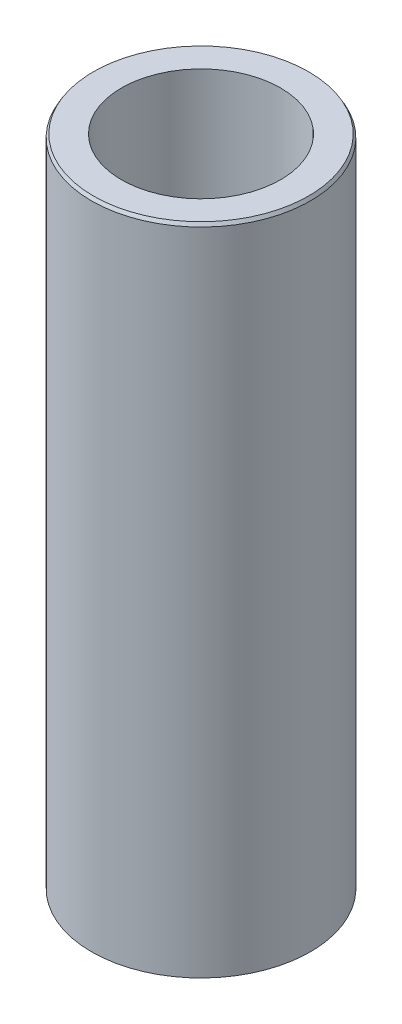
ISO-10303-21;
HEADER;
FILE_DESCRIPTION(('STEP AP214'),'2;1');
FILE_NAME('part.step','',(''),(''),'','','');
FILE_SCHEMA(('AUTOMOTIVE_DESIGN { 1 0 10303 214 1 1 1 1 }'));
ENDSEC;
DATA;
#1=APPLICATION_CONTEXT('core data for automotive mechanical design processes');
#2=APPLICATION_PROTOCOL_DEFINITION('international standard','automotive_design',2000,#1);
#3=PRODUCT_CONTEXT('',#1,'mechanical');
#4=PRODUCT('Part','Part','',(#3));
#5=PRODUCT_RELATED_PRODUCT_CATEGORY('part','',(#4));
#6=PRODUCT_DEFINITION_FORMATION('','',#4);
#7=PRODUCT_DEFINITION_CONTEXT('part definition',#1,'design');
#8=PRODUCT_DEFINITION('design','',#6,#7);
#9=PRODUCT_DEFINITION_SHAPE('','',#8);
#10=(LENGTH_UNIT() NAMED_UNIT(*) SI_UNIT(.MILLI.,.METRE.));
#11=(NAMED_UNIT(*) PLANE_ANGLE_UNIT() SI_UNIT($,.RADIAN.));
#12=(NAMED_UNIT(*) SI_UNIT($,.STERADIAN.) SOLID_ANGLE_UNIT());
#13=UNCERTAINTY_MEASURE_WITH_UNIT(LENGTH_MEASURE(1.E-05),#10,'distance_accuracy_value','');
#14=(GEOMETRIC_REPRESENTATION_CONTEXT(3) GLOBAL_UNCERTAINTY_ASSIGNED_CONTEXT((#13)) GLOBAL_UNIT_ASSIGNED_CONTEXT((#10,
#11,#12)) REPRESENTATION_CONTEXT('',''));
#15=CARTESIAN_POINT('',(0.,0.,0.));
#16=DIRECTION('',(0.,0.,1.));
#17=DIRECTION('',(1.,0.,0.));
#18=AXIS2_PLACEMENT_3D('',#15,#16,#17);
#19=CARTESIAN_POINT('',(0.,314.20717671091,0.));
#20=DIRECTION('',(0.,-1.,0.));
#21=DIRECTION('',(0.,0.,-1.));
#22=AXIS2_PLACEMENT_3D('',#19,#20,#21);
#23=CYLINDRICAL_SURFACE('',#22,52.5);
#24=CARTESIAN_POINT('',(0.,312.63607802207,0.));
#25=DIRECTION('',(0.,1.,0.));
#26=DIRECTION('',(0.,0.,1.));
#27=AXIS2_PLACEMENT_3D('',#24,#25,#26);
#28=CIRCLE('',#27,52.5);
#29=CARTESIAN_POINT('',(0.,312.63607802207,-52.5));
#30=VERTEX_POINT('',#29);
#31=EDGE_CURVE('E50',#30,#30,#28,.F.);
#32=CARTESIAN_POINT('',(0.,0.907074250925344,0.));
#33=DIRECTION('',(0.,1.,0.));
#34=DIRECTION('',(0.,0.,1.));
#35=AXIS2_PLACEMENT_3D('',#32,#33,#34);
#36=CIRCLE('',#35,52.5);
#37=CARTESIAN_POINT('',(0.,0.907074250925344,-52.5));
#38=VERTEX_POINT('',#37);
#39=EDGE_CURVE('E51',#38,#38,#36,.T.);
#40=CARTESIAN_POINT('',(0.,312.63607802207,-52.5));
#41=CARTESIAN_POINT('',(0.,309.388900899454,-52.5));
#42=CARTESIAN_POINT('',(0.,306.141723776838,-52.5));
#43=CARTESIAN_POINT('',(0.,299.647369531606,-52.5));
#44=CARTESIAN_POINT('',(0.,296.40019240899,-52.5));
#45=CARTESIAN_POINT('',(0.,289.905838163758,-52.5));
#46=CARTESIAN_POINT('',(0.,286.658661041141,-52.5));
#47=CARTESIAN_POINT('',(0.,280.164306795909,-52.5));
#48=CARTESIAN_POINT('',(0.,276.917129673293,-52.5));
#49=CARTESIAN_POINT('',(0.,270.422775428061,-52.5));
#50=CARTESIAN_POINT('',(0.,267.175598305445,-52.5));
#51=CARTESIAN_POINT('',(0.,260.681244060213,-52.5));
#52=CARTESIAN_POINT('',(0.,257.434066937597,-52.5));
#53=CARTESIAN_POINT('',(0.,250.939712692364,-52.5));
#54=CARTESIAN_POINT('',(0.,247.692535569748,-52.5));
#55=CARTESIAN_POINT('',(0.,241.198181324516,-52.5));
#56=CARTESIAN_POINT('',(0.,237.9510042019,-52.5));
#57=CARTESIAN_POINT('',(0.,231.456649956668,-52.5));
#58=CARTESIAN_POINT('',(0.,228.209472834052,-52.5));
#59=CARTESIAN_POINT('',(0.,221.71511858882,-52.5));
#60=CARTESIAN_POINT('',(0.,218.467941466204,-52.5));
#61=CARTESIAN_POINT('',(0.,211.973587220971,-52.5));
#62=CARTESIAN_POINT('',(0.,208.726410098355,-52.5));
#63=CARTESIAN_POINT('',(0.,202.232055853123,-52.5));
#64=CARTESIAN_POINT('',(0.,198.984878730507,-52.5));
#65=CARTESIAN_POINT('',(0.,192.490524485275,-52.5));
#66=CARTESIAN_POINT('',(0.,189.243347362659,-52.5));
#67=CARTESIAN_POINT('',(0.,182.748993117427,-52.5));
#68=CARTESIAN_POINT('',(0.,179.50181599481,-52.5));
#69=CARTESIAN_POINT('',(0.,173.007461749578,-52.5));
#70=CARTESIAN_POINT('',(0.,169.760284626962,-52.5));
#71=CARTESIAN_POINT('',(0.,163.26593038173,-52.5));
#72=CARTESIAN_POINT('',(0.,160.018753259114,-52.5));
#73=CARTESIAN_POINT('',(0.,153.524399013882,-52.5));
#74=CARTESIAN_POINT('',(0.,150.277221891266,-52.5));
#75=CARTESIAN_POINT('',(0.,143.782867646033,-52.5));
#76=CARTESIAN_POINT('',(0.,140.535690523417,-52.5));
#77=CARTESIAN_POINT('',(0.,134.041336278185,-52.5));
#78=CARTESIAN_POINT('',(0.,130.794159155569,-52.5));
#79=CARTESIAN_POINT('',(0.,124.299804910337,-52.5));
#80=CARTESIAN_POINT('',(0.,121.052627787721,-52.5));
#81=CARTESIAN_POINT('',(0.,114.558273542489,-52.5));
#82=CARTESIAN_POINT('',(0.,111.311096419872,-52.5));
#83=CARTESIAN_POINT('',(0.,104.81674217464,-52.5));
#84=CARTESIAN_POINT('',(0.,101.569565052024,-52.5));
#85=CARTESIAN_POINT('',(0.,95.075210806792,-52.5));
#86=CARTESIAN_POINT('',(0.,91.8280336841759,-52.5));
#87=CARTESIAN_POINT('',(0.,85.3336794389437,-52.5));
#88=CARTESIAN_POINT('',(0.,82.0865023163277,-52.5));
#89=CARTESIAN_POINT('',(0.,75.5921480710955,-52.5));
#90=CARTESIAN_POINT('',(0.,72.3449709484794,-52.5));
#91=CARTESIAN_POINT('',(0.,65.8506167032472,-52.5));
#92=CARTESIAN_POINT('',(0.,62.6034395806311,-52.5));
#93=CARTESIAN_POINT('',(0.,56.1090853353989,-52.5));
#94=CARTESIAN_POINT('',(0.,52.8619082127828,-52.5));
#95=CARTESIAN_POINT('',(0.,46.3675539675506,-52.5));
#96=CARTESIAN_POINT('',(0.,43.1203768449345,-52.5));
#97=CARTESIAN_POINT('',(0.,36.6260225997024,-52.5));
#98=CARTESIAN_POINT('',(0.,33.3788454770863,-52.5));
#99=CARTESIAN_POINT('',(0.,26.8844912318541,-52.5));
#100=CARTESIAN_POINT('',(0.,23.637314109238,-52.5));
#101=CARTESIAN_POINT('',(0.,17.1429598640058,-52.5));
#102=CARTESIAN_POINT('',(0.,13.8957827413897,-52.5));
#103=CARTESIAN_POINT('',(0.,7.40142849615753,-52.5));
#104=CARTESIAN_POINT('',(0.,4.15425137354144,-52.5));
#105=CARTESIAN_POINT('',(0.,0.907074250925344,-52.5));
#106=B_SPLINE_CURVE_WITH_KNOTS('',3,(#40,#41,#42,#43,#44,#45,#46,#47,#48,#49,#50,#51,#52,#53,
#54,#55,#56,#57,#58,#59,#60,#61,#62,#63,#64,#65,#66,#67,#68,#69,#70,#71,#72,#73,#74,#75,#76,#77,
#78,#79,#80,#81,#82,#83,#84,#85,#86,#87,#88,#89,#90,#91,#92,#93,#94,#95,#96,#97,#98,#99,#100,
#101,#102,#103,#104,#105),.UNSPECIFIED.,.F.,.F.,(4,2,2,2,2,2,2,2,2,2,2,2,2,2,2,2,2,2,2,2,2,2,2,
2,2,2,2,2,2,2,2,2,4),(0.,9.74153136784828,19.4830627356966,29.2245941035448,38.9661254713931,
48.7076568392414,58.4491882070897,68.1907195749379,77.9322509427862,87.6737823106345,
97.4153136784828,107.156845046331,116.898376414179,126.639907782028,136.381439149876,
146.122970517724,155.864501885572,165.606033253421,175.347564621269,185.089095989117,
194.830627356966,204.572158724814,214.313690092662,224.05522146051,233.796752828359,
243.538284196207,253.279815564055,263.021346931904,272.762878299752,282.5044096676,
292.245941035448,301.987472403297,311.729003771145),.UNSPECIFIED.);
#107=EDGE_CURVE('BSEAM39',#30,#38,#106,.T.);
#108=ORIENTED_EDGE('',*,*,#31,.T.);
#109=ORIENTED_EDGE('',*,*,#39,.T.);
#110=ORIENTED_EDGE('',*,*,#107,.T.);
#111=ORIENTED_EDGE('',*,*,#107,.F.);
#112=EDGE_LOOP('',(#108,#110,#109,#111));
#113=FACE_BOUND('',#112,.T.);
#114=ADVANCED_FACE('F39',(#113),#23,.T.);
#115=CARTESIAN_POINT('',(0.,314.20717671091,0.));
#116=DIRECTION('',(0.,1.,0.));
#117=DIRECTION('',(0.,0.,1.));
#118=AXIS2_PLACEMENT_3D('',#115,#116,#117);
#119=PLANE('',#118);
#120=CARTESIAN_POINT('',(0.,314.20717671091,0.));
#121=DIRECTION('',(0.,1.,0.));
#122=DIRECTION('',(0.,0.,1.));
#123=AXIS2_PLACEMENT_3D('',#120,#121,#122);
#124=CIRCLE('',#123,51.5929257490749);
#125=CARTESIAN_POINT('',(0.,314.20717671091,51.5929257490749));
#126=VERTEX_POINT('',#125);
#127=EDGE_CURVE('E54',#126,#126,#124,.T.);
#128=ORIENTED_EDGE('',*,*,#127,.T.);
#129=EDGE_LOOP('',(#128));
#130=FACE_BOUND('',#129,.T.);
#131=CARTESIAN_POINT('',(0.,314.20717671091,0.));
#132=DIRECTION('',(0.,1.,0.));
#133=DIRECTION('',(0.,0.,1.));
#134=AXIS2_PLACEMENT_3D('',#131,#132,#133);
#135=CIRCLE('',#134,38.1459132460685);
#136=CARTESIAN_POINT('',(0.,314.20717671091,-38.1459132460685));
#137=VERTEX_POINT('',#136);
#138=EDGE_CURVE('E58',#137,#137,#135,.T.);
#139=ORIENTED_EDGE('',*,*,#138,.F.);
#140=EDGE_LOOP('',(#139));
#141=FACE_BOUND('',#140,.T.);
#142=ADVANCED_FACE('F69',(#130,#141),#119,.T.);
#143=CARTESIAN_POINT('',(0.,0.,0.));
#144=DIRECTION('',(0.,1.,0.));
#145=DIRECTION('',(0.,0.,1.));
#146=AXIS2_PLACEMENT_3D('',#143,#144,#145);
#147=PLANE('',#146);
#148=CARTESIAN_POINT('',(0.,0.,0.));
#149=DIRECTION('',(0.,1.,0.));
#150=DIRECTION('',(0.,0.,1.));
#151=AXIS2_PLACEMENT_3D('',#148,#149,#150);
#152=CIRCLE('',#151,50.9289013111597);
#153=CARTESIAN_POINT('',(0.,0.,50.9289013111597));
#154=VERTEX_POINT('',#153);
#155=EDGE_CURVE('E10',#154,#154,#152,.F.);
#156=ORIENTED_EDGE('',*,*,#155,.T.);
#157=EDGE_LOOP('',(#156));
#158=FACE_BOUND('',#157,.T.);
#159=CARTESIAN_POINT('',(0.,0.,0.));
#160=DIRECTION('',(0.,1.,0.));
#161=DIRECTION('',(0.,0.,1.));
#162=AXIS2_PLACEMENT_3D('',#159,#160,#161);
#163=CIRCLE('',#162,38.1459132460685);
#164=CARTESIAN_POINT('',(0.,0.,-38.1459132460685));
#165=VERTEX_POINT('',#164);
#166=EDGE_CURVE('E63',#165,#165,#163,.T.);
#167=ORIENTED_EDGE('',*,*,#166,.T.);
#168=EDGE_LOOP('',(#167));
#169=FACE_BOUND('',#168,.T.);
#170=ADVANCED_FACE('F75',(#158,#169),#147,.F.);
#171=CARTESIAN_POINT('',(0.,314.20717671091,0.));
#172=DIRECTION('',(0.,-1.,0.));
#173=DIRECTION('',(0.,0.,-1.));
#174=AXIS2_PLACEMENT_3D('',#171,#172,#173);
#175=CYLINDRICAL_SURFACE('',#174,38.1459132460685);
#176=CARTESIAN_POINT('',(0.,314.20717671091,-38.1459132460685));
#177=CARTESIAN_POINT('',(0.,310.934185286838,-38.1459132460685));
#178=CARTESIAN_POINT('',(0.,307.661193862766,-38.1459132460685));
#179=CARTESIAN_POINT('',(0.,301.115211014622,-38.1459132460685));
#180=CARTESIAN_POINT('',(0.,297.84221959055,-38.1459132460685));
#181=CARTESIAN_POINT('',(0.,291.296236742406,-38.1459132460685));
#182=CARTESIAN_POINT('',(0.,288.023245318334,-38.1459132460685));
#183=CARTESIAN_POINT('',(0.,281.47726247019,-38.1459132460685));
#184=CARTESIAN_POINT('',(0.,278.204271046118,-38.1459132460685));
#185=CARTESIAN_POINT('',(0.,271.658288197974,-38.1459132460685));
#186=CARTESIAN_POINT('',(0.,268.385296773902,-38.1459132460685));
#187=CARTESIAN_POINT('',(0.,261.839313925758,-38.1459132460685));
#188=CARTESIAN_POINT('',(0.,258.566322501686,-38.1459132460685));
#189=CARTESIAN_POINT('',(0.,252.020339653542,-38.1459132460685));
#190=CARTESIAN_POINT('',(0.,248.74734822947,-38.1459132460685));
#191=CARTESIAN_POINT('',(0.,242.201365381326,-38.1459132460685));
#192=CARTESIAN_POINT('',(0.,238.928373957254,-38.1459132460685));
#193=CARTESIAN_POINT('',(0.,232.38239110911,-38.1459132460685));
#194=CARTESIAN_POINT('',(0.,229.109399685038,-38.1459132460685));
#195=CARTESIAN_POINT('',(0.,222.563416836894,-38.1459132460685));
#196=CARTESIAN_POINT('',(0.,219.290425412823,-38.1459132460685));
#197=CARTESIAN_POINT('',(0.,212.744442564679,-38.1459132460685));
#198=CARTESIAN_POINT('',(0.,209.471451140607,-38.1459132460685));
#199=CARTESIAN_POINT('',(0.,202.925468292463,-38.1459132460685));
#200=CARTESIAN_POINT('',(0.,199.652476868391,-38.1459132460685));
#201=CARTESIAN_POINT('',(0.,193.106494020247,-38.1459132460685));
#202=CARTESIAN_POINT('',(0.,189.833502596175,-38.1459132460685));
#203=CARTESIAN_POINT('',(0.,183.287519748031,-38.1459132460685));
#204=CARTESIAN_POINT('',(0.,180.014528323959,-38.1459132460685));
#205=CARTESIAN_POINT('',(0.,173.468545475815,-38.1459132460685));
#206=CARTESIAN_POINT('',(0.,170.195554051743,-38.1459132460685));
#207=CARTESIAN_POINT('',(0.,163.649571203599,-38.1459132460685));
#208=CARTESIAN_POINT('',(0.,160.376579779527,-38.1459132460685));
#209=CARTESIAN_POINT('',(0.,153.830596931383,-38.1459132460685));
#210=CARTESIAN_POINT('',(0.,150.557605507311,-38.1459132460685));
#211=CARTESIAN_POINT('',(0.,144.011622659167,-38.1459132460685));
#212=CARTESIAN_POINT('',(0.,140.738631235095,-38.1459132460685));
#213=CARTESIAN_POINT('',(0.,134.192648386951,-38.1459132460685));
#214=CARTESIAN_POINT('',(0.,130.919656962879,-38.1459132460685));
#215=CARTESIAN_POINT('',(0.,124.373674114735,-38.1459132460685));
#216=CARTESIAN_POINT('',(0.,121.100682690663,-38.1459132460685));
#217=CARTESIAN_POINT('',(0.,114.554699842519,-38.1459132460685));
#218=CARTESIAN_POINT('',(0.,111.281708418447,-38.1459132460685));
#219=CARTESIAN_POINT('',(0.,104.735725570303,-38.1459132460685));
#220=CARTESIAN_POINT('',(0.,101.462734146231,-38.1459132460685));
#221=CARTESIAN_POINT('',(0.,94.9167512980873,-38.1459132460685));
#222=CARTESIAN_POINT('',(0.,91.6437598740153,-38.1459132460685));
#223=CARTESIAN_POINT('',(0.,85.0977770258714,-38.1459132460685));
#224=CARTESIAN_POINT('',(0.,81.8247856017994,-38.1459132460685));
#225=CARTESIAN_POINT('',(0.,75.2788027536555,-38.1459132460685));
#226=CARTESIAN_POINT('',(0.,72.0058113295835,-38.1459132460685));
#227=CARTESIAN_POINT('',(0.,65.4598284814395,-38.1459132460685));
#228=CARTESIAN_POINT('',(0.,62.1868370573675,-38.1459132460685));
#229=CARTESIAN_POINT('',(0.,55.6408542092236,-38.1459132460685));
#230=CARTESIAN_POINT('',(0.,52.3678627851516,-38.1459132460685));
#231=CARTESIAN_POINT('',(0.,45.8218799370077,-38.1459132460685));
#232=CARTESIAN_POINT('',(0.,42.5488885129357,-38.1459132460685));
#233=CARTESIAN_POINT('',(0.,36.0029056647917,-38.1459132460685));
#234=CARTESIAN_POINT('',(0.,32.7299142407197,-38.1459132460685));
#235=CARTESIAN_POINT('',(0.,26.1839313925758,-38.1459132460685));
#236=CARTESIAN_POINT('',(0.,22.9109399685038,-38.1459132460685));
#237=CARTESIAN_POINT('',(0.,16.3649571203598,-38.1459132460685));
#238=CARTESIAN_POINT('',(0.,13.0919656962879,-38.1459132460685));
#239=CARTESIAN_POINT('',(0.,6.54598284814391,-38.1459132460685));
#240=CARTESIAN_POINT('',(0.,3.27299142407193,-38.1459132460685));
#241=CARTESIAN_POINT('',(0.,0.,-38.1459132460685));
#242=B_SPLINE_CURVE_WITH_KNOTS('',3,(#176,#177,#178,#179,#180,#181,#182,#183,#184,#185,#186,
#187,#188,#189,#190,#191,#192,#193,#194,#195,#196,#197,#198,#199,#200,#201,#202,#203,#204,#205,
#206,#207,#208,#209,#210,#211,#212,#213,#214,#215,#216,#217,#218,#219,#220,#221,#222,#223,#224,
#225,#226,#227,#228,#229,#230,#231,#232,#233,#234,#235,#236,#237,#238,#239,#240,#241),
.UNSPECIFIED.,.F.,.F.,(4,2,2,2,2,2,2,2,2,2,2,2,2,2,2,2,2,2,2,2,2,2,2,2,2,2,2,2,2,2,2,2,4),(0.,
9.8189742722159,19.6379485444319,29.4569228166478,39.2758970888637,49.0948713610796,
58.9138456332956,68.7328199055115,78.5517941777275,88.3707684499434,98.1897427221593,
108.008716994375,117.827691266591,127.646665538807,137.465639811023,147.284614083239,
157.103588355455,166.922562627671,176.741536899887,186.560511172103,196.379485444319,
206.198459716535,216.017433988751,225.836408260966,235.655382533182,245.474356805398,
255.293331077614,265.11230534983,274.931279622046,284.750253894262,294.569228166478,
304.388202438694,314.20717671091),.UNSPECIFIED.);
#243=EDGE_CURVE('BSEAM70',#137,#165,#242,.T.);
#244=ORIENTED_EDGE('',*,*,#138,.T.);
#245=ORIENTED_EDGE('',*,*,#166,.F.);
#246=ORIENTED_EDGE('',*,*,#243,.T.);
#247=ORIENTED_EDGE('',*,*,#243,.F.);
#248=EDGE_LOOP('',(#244,#246,#245,#247));
#249=FACE_BOUND('',#248,.T.);
#250=ADVANCED_FACE('F70',(#249),#175,.F.);
#251=CARTESIAN_POINT('',(0.,314.20717671091,0.));
#252=DIRECTION('',(0.,-1.,0.));
#253=DIRECTION('',(0.,0.,-1.));
#254=AXIS2_PLACEMENT_3D('',#251,#252,#253);
#255=CONICAL_SURFACE('',#254,51.5929257490749,0.523598775598291);
#256=ORIENTED_EDGE('',*,*,#31,.F.);
#257=EDGE_LOOP('',(#256));
#258=FACE_BOUND('',#257,.T.);
#259=ORIENTED_EDGE('',*,*,#127,.F.);
#260=EDGE_LOOP('',(#259));
#261=FACE_BOUND('',#260,.T.);
#262=ADVANCED_FACE('F81',(#258,#261),#255,.T.);
#263=CARTESIAN_POINT('',(0.,0.907074250925344,0.));
#264=DIRECTION('',(0.,1.,0.));
#265=DIRECTION('',(0.,0.,1.));
#266=AXIS2_PLACEMENT_3D('',#263,#264,#265);
#267=CONICAL_SURFACE('',#266,52.5,1.04719755119662);
#268=ORIENTED_EDGE('',*,*,#155,.F.);
#269=EDGE_LOOP('',(#268));
#270=FACE_BOUND('',#269,.T.);
#271=ORIENTED_EDGE('',*,*,#39,.F.);
#272=EDGE_LOOP('',(#271));
#273=FACE_BOUND('',#272,.T.);
#274=ADVANCED_FACE('F45',(#270,#273),#267,.T.);
#275=CLOSED_SHELL('',(#114,#142,#170,#250,#262,#274));
#276=MANIFOLD_SOLID_BREP('B2',#275);
#277=ADVANCED_BREP_SHAPE_REPRESENTATION('',(#18,#276),#14);
#278=SHAPE_DEFINITION_REPRESENTATION(#9,#277);
ENDSEC;
END-ISO-10303-21;
